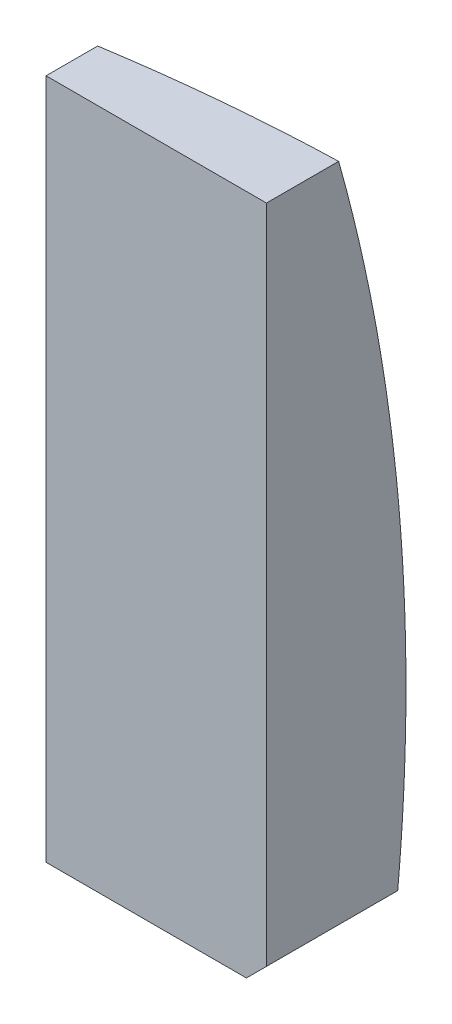
ISO-10303-21;
HEADER;
FILE_DESCRIPTION(('STEP AP214'),'2;1');
FILE_NAME('part.step','',(''),(''),'','','');
FILE_SCHEMA(('AUTOMOTIVE_DESIGN { 1 0 10303 214 1 1 1 1 }'));
ENDSEC;
DATA;
#1=APPLICATION_CONTEXT('core data for automotive mechanical design processes');
#2=APPLICATION_PROTOCOL_DEFINITION('international standard','automotive_design',2000,#1);
#3=PRODUCT_CONTEXT('',#1,'mechanical');
#4=PRODUCT('Part','Part','',(#3));
#5=PRODUCT_RELATED_PRODUCT_CATEGORY('part','',(#4));
#6=PRODUCT_DEFINITION_FORMATION('','',#4);
#7=PRODUCT_DEFINITION_CONTEXT('part definition',#1,'design');
#8=PRODUCT_DEFINITION('design','',#6,#7);
#9=PRODUCT_DEFINITION_SHAPE('','',#8);
#10=(LENGTH_UNIT() NAMED_UNIT(*) SI_UNIT(.MILLI.,.METRE.));
#11=(NAMED_UNIT(*) PLANE_ANGLE_UNIT() SI_UNIT($,.RADIAN.));
#12=(NAMED_UNIT(*) SI_UNIT($,.STERADIAN.) SOLID_ANGLE_UNIT());
#13=UNCERTAINTY_MEASURE_WITH_UNIT(LENGTH_MEASURE(1.E-05),#10,'distance_accuracy_value','');
#14=(GEOMETRIC_REPRESENTATION_CONTEXT(3) GLOBAL_UNCERTAINTY_ASSIGNED_CONTEXT((#13)) GLOBAL_UNIT_ASSIGNED_CONTEXT((#10,
#11,#12)) REPRESENTATION_CONTEXT('',''));
#15=CARTESIAN_POINT('',(0.,0.,0.));
#16=DIRECTION('',(0.,0.,1.));
#17=DIRECTION('',(1.,0.,0.));
#18=AXIS2_PLACEMENT_3D('',#15,#16,#17);
#19=CARTESIAN_POINT('',(0.,0.,0.));
#20=DIRECTION('',(0.,0.,-1.));
#21=DIRECTION('',(-1.,0.,0.));
#22=AXIS2_PLACEMENT_3D('',#19,#20,#21);
#23=PLANE('',#22);
#24=DIRECTION('',(-1.,0.,0.));
#25=VECTOR('',#24,1.);
#26=CARTESIAN_POINT('',(0.,-4.8,0.));
#27=LINE('',#26,#25);
#28=CARTESIAN_POINT('',(-1.8,-4.8,0.));
#29=VERTEX_POINT('',#28);
#30=CARTESIAN_POINT('',(-6.79999999999999,-4.8,0.));
#31=VERTEX_POINT('',#30);
#32=EDGE_CURVE('E103',#29,#31,#27,.T.);
#33=ORIENTED_EDGE('',*,*,#32,.F.);
#34=DIRECTION('',(-0.707106781186545,-0.70710678118655,0.));
#35=VECTOR('',#34,1.);
#36=CARTESIAN_POINT('',(-1.8,-4.8,0.));
#37=LINE('',#36,#35);
#38=CARTESIAN_POINT('',(-1.29999999999999,-4.29999999999999,0.));
#39=VERTEX_POINT('',#38);
#40=EDGE_CURVE('E78',#29,#39,#37,.F.);
#41=ORIENTED_EDGE('',*,*,#40,.T.);
#42=DIRECTION('',(0.,-1.,0.));
#43=VECTOR('',#42,1.);
#44=CARTESIAN_POINT('',(-1.29999999999999,-30.9414213562373,0.));
#45=LINE('',#44,#43);
#46=CARTESIAN_POINT('',(-1.3,12.2,0.));
#47=VERTEX_POINT('',#46);
#48=EDGE_CURVE('E128',#47,#39,#45,.T.);
#49=ORIENTED_EDGE('',*,*,#48,.F.);
#50=DIRECTION('',(-1.,0.,0.));
#51=VECTOR('',#50,1.);
#52=CARTESIAN_POINT('',(0.,12.2,0.));
#53=LINE('',#52,#51);
#54=CARTESIAN_POINT('',(-6.8,12.2,0.));
#55=VERTEX_POINT('',#54);
#56=EDGE_CURVE('E126',#47,#55,#53,.T.);
#57=ORIENTED_EDGE('',*,*,#56,.T.);
#58=DIRECTION('',(0.,-1.,0.));
#59=VECTOR('',#58,1.);
#60=CARTESIAN_POINT('',(-6.79999999999999,-30.9414213562373,0.));
#61=LINE('',#60,#59);
#62=EDGE_CURVE('E112',#55,#31,#61,.T.);
#63=ORIENTED_EDGE('',*,*,#62,.T.);
#64=EDGE_LOOP('',(#33,#41,#49,#57,#63));
#65=FACE_BOUND('',#64,.T.);
#66=ADVANCED_FACE('F56',(#65),#23,.F.);
#67=CARTESIAN_POINT('',(-1.29999999999999,-30.9414213562373,-3.5));
#68=DIRECTION('',(-1.,0.,0.));
#69=DIRECTION('',(0.,-1.,0.));
#70=AXIS2_PLACEMENT_3D('',#67,#68,#69);
#71=PLANE('',#70);
#72=ORIENTED_EDGE('',*,*,#48,.T.);
#73=DIRECTION('',(0.,0.,-1.));
#74=VECTOR('',#73,1.);
#75=CARTESIAN_POINT('',(-1.29999999999999,-4.29999999999999,-3.5));
#76=LINE('',#75,#74);
#77=CARTESIAN_POINT('',(-1.29999999999999,-4.29999999999999,-3.27616616968807));
#78=VERTEX_POINT('',#77);
#79=EDGE_CURVE('E64',#39,#78,#76,.T.);
#80=ORIENTED_EDGE('',*,*,#79,.T.);
#81=CARTESIAN_POINT('',(-1.29999999999999,0.,41.69));
#82=DIRECTION('',(-1.,0.,0.));
#83=DIRECTION('',(0.,-1.,0.));
#84=AXIS2_PLACEMENT_3D('',#81,#82,#83);
#85=CIRCLE('',#84,45.1712973026014);
#86=CARTESIAN_POINT('',(-1.3,12.2,-1.80259822084673));
#87=VERTEX_POINT('',#86);
#88=EDGE_CURVE('E138',#87,#78,#85,.T.);
#89=ORIENTED_EDGE('',*,*,#88,.F.);
#90=DIRECTION('',(0.,0.,1.));
#91=VECTOR('',#90,1.);
#92=CARTESIAN_POINT('',(-1.3,12.2,-3.5));
#93=LINE('',#92,#91);
#94=EDGE_CURVE('E111',#87,#47,#93,.T.);
#95=ORIENTED_EDGE('',*,*,#94,.T.);
#96=EDGE_LOOP('',(#72,#80,#89,#95));
#97=FACE_BOUND('',#96,.T.);
#98=ADVANCED_FACE('F152',(#97),#71,.F.);
#99=CARTESIAN_POINT('',(0.,-4.8,-3.5));
#100=DIRECTION('',(0.,1.,0.));
#101=DIRECTION('',(-1.,0.,0.));
#102=AXIS2_PLACEMENT_3D('',#99,#100,#101);
#103=PLANE('',#102);
#104=CARTESIAN_POINT('',(0.,-4.8,41.69));
#105=DIRECTION('',(0.,1.,0.));
#106=DIRECTION('',(-1.,0.,0.));
#107=AXIS2_PLACEMENT_3D('',#104,#105,#106);
#108=CIRCLE('',#107,44.9343532277922);
#109=CARTESIAN_POINT('',(-1.79999999999999,-4.8,-3.20828615882794));
#110=VERTEX_POINT('',#109);
#111=CARTESIAN_POINT('',(-6.79999999999999,-4.8,-2.72684477762913));
#112=VERTEX_POINT('',#111);
#113=EDGE_CURVE('E136',#110,#112,#108,.T.);
#114=ORIENTED_EDGE('',*,*,#113,.F.);
#115=DIRECTION('',(0.,0.,1.));
#116=VECTOR('',#115,1.);
#117=CARTESIAN_POINT('',(-1.8,-4.8,-3.5));
#118=LINE('',#117,#116);
#119=EDGE_CURVE('E109',#110,#29,#118,.T.);
#120=ORIENTED_EDGE('',*,*,#119,.T.);
#121=ORIENTED_EDGE('',*,*,#32,.T.);
#122=DIRECTION('',(0.,0.,1.));
#123=VECTOR('',#122,1.);
#124=CARTESIAN_POINT('',(-6.79999999999999,-4.8,-3.5));
#125=LINE('',#124,#123);
#126=EDGE_CURVE('E107',#112,#31,#125,.T.);
#127=ORIENTED_EDGE('',*,*,#126,.F.);
#128=EDGE_LOOP('',(#114,#120,#121,#127));
#129=FACE_BOUND('',#128,.T.);
#130=ADVANCED_FACE('F106',(#129),#103,.F.);
#131=CARTESIAN_POINT('',(-6.79999999999999,-30.9414213562373,-3.5));
#132=DIRECTION('',(-1.,0.,0.));
#133=DIRECTION('',(0.,-1.,0.));
#134=AXIS2_PLACEMENT_3D('',#131,#132,#133);
#135=PLANE('',#134);
#136=CARTESIAN_POINT('',(-6.79999999999999,0.,41.69));
#137=DIRECTION('',(-1.,0.,0.));
#138=DIRECTION('',(0.,-1.,0.));
#139=AXIS2_PLACEMENT_3D('',#136,#137,#138);
#140=CIRCLE('',#139,44.6754529915478);
#141=CARTESIAN_POINT('',(-6.79999999999999,12.2,-1.28739056759961));
#142=VERTEX_POINT('',#141);
#143=EDGE_CURVE('E120',#142,#112,#140,.T.);
#144=ORIENTED_EDGE('',*,*,#143,.T.);
#145=ORIENTED_EDGE('',*,*,#126,.T.);
#146=ORIENTED_EDGE('',*,*,#62,.F.);
#147=DIRECTION('',(0.,0.,1.));
#148=VECTOR('',#147,1.);
#149=CARTESIAN_POINT('',(-6.8,12.2,-3.5));
#150=LINE('',#149,#148);
#151=EDGE_CURVE('E122',#142,#55,#150,.T.);
#152=ORIENTED_EDGE('',*,*,#151,.F.);
#153=EDGE_LOOP('',(#144,#145,#146,#152));
#154=FACE_BOUND('',#153,.T.);
#155=ADVANCED_FACE('F116',(#154),#135,.T.);
#156=CARTESIAN_POINT('',(0.,12.2,-3.5));
#157=DIRECTION('',(0.,1.,0.));
#158=DIRECTION('',(-1.,0.,0.));
#159=AXIS2_PLACEMENT_3D('',#156,#157,#158);
#160=PLANE('',#159);
#161=CARTESIAN_POINT('',(0.,12.2,41.69));
#162=DIRECTION('',(0.,1.,0.));
#163=DIRECTION('',(-1.,0.,0.));
#164=AXIS2_PLACEMENT_3D('',#161,#162,#163);
#165=CIRCLE('',#164,43.5120224765524);
#166=EDGE_CURVE('E121',#87,#142,#165,.T.);
#167=ORIENTED_EDGE('',*,*,#166,.T.);
#168=ORIENTED_EDGE('',*,*,#151,.T.);
#169=ORIENTED_EDGE('',*,*,#56,.F.);
#170=ORIENTED_EDGE('',*,*,#94,.F.);
#171=EDGE_LOOP('',(#167,#168,#169,#170));
#172=FACE_BOUND('',#171,.T.);
#173=ADVANCED_FACE('F150',(#172),#160,.T.);
#174=CARTESIAN_POINT('',(0.,0.,41.69));
#175=DIRECTION('',(0.,0.,-1.));
#176=DIRECTION('',(1.,0.,0.));
#177=AXIS2_PLACEMENT_3D('',#174,#175,#176);
#178=SPHERICAL_SURFACE('',#177,45.19);
#179=ORIENTED_EDGE('',*,*,#88,.T.);
#180=CARTESIAN_POINT('',(1.5,-1.49999999999998,41.69));
#181=DIRECTION('',(-0.70710678118655,0.707106781186545,0.));
#182=DIRECTION('',(-0.707106781186545,-0.70710678118655,0.));
#183=AXIS2_PLACEMENT_3D('',#180,#181,#182);
#184=CIRCLE('',#183,45.140182764362);
#185=EDGE_CURVE('E13',#78,#110,#184,.T.);
#186=ORIENTED_EDGE('',*,*,#185,.T.);
#187=ORIENTED_EDGE('',*,*,#113,.T.);
#188=ORIENTED_EDGE('',*,*,#143,.F.);
#189=ORIENTED_EDGE('',*,*,#166,.F.);
#190=EDGE_LOOP('',(#179,#186,#187,#188,#189));
#191=FACE_BOUND('',#190,.T.);
#192=ADVANCED_FACE('F144',(#191),#178,.T.);
#193=CARTESIAN_POINT('',(-1.8,-4.8,-3.5));
#194=DIRECTION('',(-0.70710678118655,0.707106781186545,0.));
#195=DIRECTION('',(-0.707106781186545,-0.70710678118655,0.));
#196=AXIS2_PLACEMENT_3D('',#193,#194,#195);
#197=PLANE('',#196);
#198=ORIENTED_EDGE('',*,*,#185,.F.);
#199=ORIENTED_EDGE('',*,*,#79,.F.);
#200=ORIENTED_EDGE('',*,*,#40,.F.);
#201=ORIENTED_EDGE('',*,*,#119,.F.);
#202=EDGE_LOOP('',(#198,#199,#200,#201));
#203=FACE_BOUND('',#202,.T.);
#204=ADVANCED_FACE('F58',(#203),#197,.F.);
#205=CLOSED_SHELL('',(#66,#98,#130,#155,#173,#192,#204));
#206=MANIFOLD_SOLID_BREP('B2',#205);
#207=ADVANCED_BREP_SHAPE_REPRESENTATION('',(#18,#206),#14);
#208=SHAPE_DEFINITION_REPRESENTATION(#9,#207);
ENDSEC;
END-ISO-10303-21;
